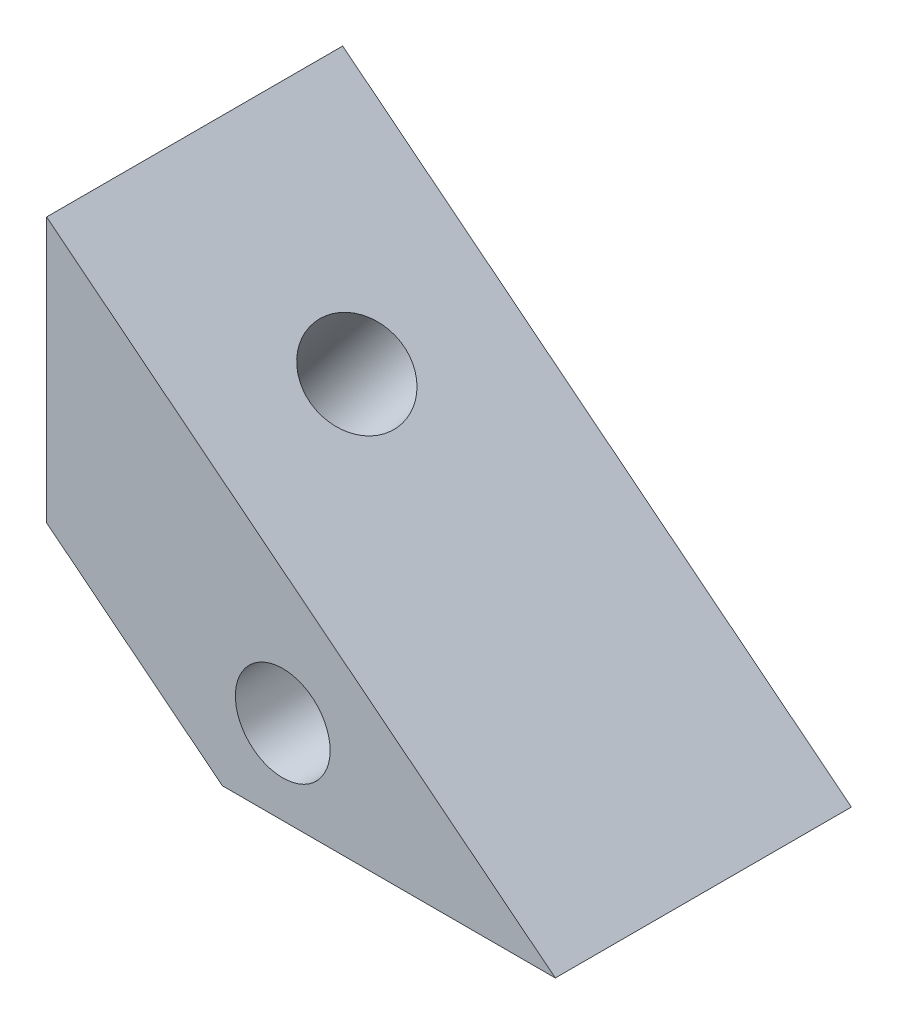
ISO-10303-21;
HEADER;
FILE_DESCRIPTION(('STEP AP214'),'2;1');
FILE_NAME('part.step','',(''),(''),'','','');
FILE_SCHEMA(('AUTOMOTIVE_DESIGN { 1 0 10303 214 1 1 1 1 }'));
ENDSEC;
DATA;
#1=APPLICATION_CONTEXT('core data for automotive mechanical design processes');
#2=APPLICATION_PROTOCOL_DEFINITION('international standard','automotive_design',2000,#1);
#3=PRODUCT_CONTEXT('',#1,'mechanical');
#4=PRODUCT('Part','Part','',(#3));
#5=PRODUCT_RELATED_PRODUCT_CATEGORY('part','',(#4));
#6=PRODUCT_DEFINITION_FORMATION('','',#4);
#7=PRODUCT_DEFINITION_CONTEXT('part definition',#1,'design');
#8=PRODUCT_DEFINITION('design','',#6,#7);
#9=PRODUCT_DEFINITION_SHAPE('','',#8);
#10=(LENGTH_UNIT() NAMED_UNIT(*) SI_UNIT(.MILLI.,.METRE.));
#11=(NAMED_UNIT(*) PLANE_ANGLE_UNIT() SI_UNIT($,.RADIAN.));
#12=(NAMED_UNIT(*) SI_UNIT($,.STERADIAN.) SOLID_ANGLE_UNIT());
#13=UNCERTAINTY_MEASURE_WITH_UNIT(LENGTH_MEASURE(1.E-05),#10,'distance_accuracy_value','');
#14=(GEOMETRIC_REPRESENTATION_CONTEXT(3) GLOBAL_UNCERTAINTY_ASSIGNED_CONTEXT((#13)) GLOBAL_UNIT_ASSIGNED_CONTEXT((#10,
#11,#12)) REPRESENTATION_CONTEXT('',''));
#15=CARTESIAN_POINT('',(0.,0.,0.));
#16=DIRECTION('',(0.,0.,1.));
#17=DIRECTION('',(1.,0.,0.));
#18=AXIS2_PLACEMENT_3D('',#15,#16,#17);
#19=CARTESIAN_POINT('',(-1.18087962656431,0.937540612039793,-5.));
#20=DIRECTION('',(0.622523565821539,0.782601054175649,0.));
#21=DIRECTION('',(-0.782601054175649,0.622523565821539,0.));
#22=AXIS2_PLACEMENT_3D('',#19,#20,#21);
#23=CYLINDRICAL_SURFACE('',#22,1.6);
#24=CARTESIAN_POINT('',(5.47820737922954,9.30896427646635,-5.));
#25=DIRECTION('',(-0.622523565821539,-0.782601054175649,0.));
#26=DIRECTION('',(-0.782601054175649,0.622523565821539,0.));
#27=AXIS2_PLACEMENT_3D('',#24,#25,#26);
#28=CIRCLE('',#27,1.6);
#29=CARTESIAN_POINT('',(4.2260456925485,10.3050019817808,-5.));
#30=VERTEX_POINT('',#29);
#31=EDGE_CURVE('E205',#30,#30,#28,.T.);
#32=ORIENTED_EDGE('',*,*,#31,.F.);
#33=EDGE_LOOP('',(#32));
#34=FACE_BOUND('',#33,.T.);
#35=CARTESIAN_POINT('',(2.67685133303261,5.78725953267592,-5.));
#36=DIRECTION('',(0.622523565821539,0.782601054175649,0.));
#37=DIRECTION('',(0.782601054175649,-0.622523565821539,0.));
#38=AXIS2_PLACEMENT_3D('',#35,#36,#37);
#39=CIRCLE('',#38,1.6);
#40=CARTESIAN_POINT('',(3.92901301971365,4.79122182736146,-5.));
#41=VERTEX_POINT('',#40);
#42=EDGE_CURVE('E197',#41,#41,#39,.F.);
#43=ORIENTED_EDGE('',*,*,#42,.T.);
#44=EDGE_LOOP('',(#43));
#45=FACE_BOUND('',#44,.T.);
#46=ADVANCED_FACE('F34',(#34,#45),#23,.F.);
#47=CARTESIAN_POINT('',(7.97577106518184,2.85,-10.));
#48=DIRECTION('',(0.,0.,1.));
#49=DIRECTION('',(-1.,0.,0.));
#50=AXIS2_PLACEMENT_3D('',#47,#48,#49);
#51=CYLINDRICAL_SURFACE('',#50,1.6);
#52=CARTESIAN_POINT('',(7.97577106518184,2.85,0.));
#53=DIRECTION('',(0.,0.,1.));
#54=DIRECTION('',(1.,0.,0.));
#55=AXIS2_PLACEMENT_3D('',#52,#53,#54);
#56=CIRCLE('',#55,1.6);
#57=CARTESIAN_POINT('',(9.57577106518184,2.85,0.));
#58=VERTEX_POINT('',#57);
#59=EDGE_CURVE('E253',#58,#58,#56,.T.);
#60=ORIENTED_EDGE('',*,*,#59,.T.);
#61=EDGE_LOOP('',(#60));
#62=FACE_BOUND('',#61,.T.);
#63=CARTESIAN_POINT('',(7.97577106518184,2.85,-4.5));
#64=DIRECTION('',(0.,0.,1.));
#65=DIRECTION('',(1.,0.,0.));
#66=AXIS2_PLACEMENT_3D('',#63,#64,#65);
#67=CIRCLE('',#66,1.6);
#68=CARTESIAN_POINT('',(9.57577106518184,2.85,-4.5));
#69=VERTEX_POINT('',#68);
#70=EDGE_CURVE('E252',#69,#69,#67,.T.);
#71=ORIENTED_EDGE('',*,*,#70,.F.);
#72=EDGE_LOOP('',(#71));
#73=FACE_BOUND('',#72,.T.);
#74=ADVANCED_FACE('F343',(#62,#73),#51,.F.);
#75=CARTESIAN_POINT('',(0.,13.6666292372171,-10.));
#76=DIRECTION('',(0.,0.,-1.));
#77=DIRECTION('',(1.,0.,0.));
#78=AXIS2_PLACEMENT_3D('',#75,#76,#77);
#79=PLANE('',#78);
#80=DIRECTION('',(0.500000000000001,-0.866025403784438,0.));
#81=VECTOR('',#80,1.);
#82=CARTESIAN_POINT('',(4.68487453080097,2.85,-10.));
#83=LINE('',#82,#81);
#84=CARTESIAN_POINT('',(4.68487453080097,2.85,-10.));
#85=VERTEX_POINT('',#84);
#86=CARTESIAN_POINT('',(6.33032279799141,0.,-10.));
#87=VERTEX_POINT('',#86);
#88=EDGE_CURVE('E208',#85,#87,#83,.T.);
#89=ORIENTED_EDGE('',*,*,#88,.T.);
#90=DIRECTION('',(1.,0.,0.));
#91=VECTOR('',#90,1.);
#92=CARTESIAN_POINT('',(17.1809053267872,0.,-10.));
#93=LINE('',#92,#91);
#94=CARTESIAN_POINT('',(5.93635108929075,0.,-10.));
#95=VERTEX_POINT('',#94);
#96=EDGE_CURVE('E268',#95,#87,#93,.T.);
#97=ORIENTED_EDGE('',*,*,#96,.F.);
#98=DIRECTION('',(0.782601054175649,-0.622523565821538,0.));
#99=VECTOR('',#98,1.);
#100=CARTESIAN_POINT('',(5.93635108929075,0.,-10.));
#101=LINE('',#100,#99);
#102=CARTESIAN_POINT('',(0.,4.72209745739037,-10.));
#103=VERTEX_POINT('',#102);
#104=EDGE_CURVE('E264',#103,#95,#101,.T.);
#105=ORIENTED_EDGE('',*,*,#104,.F.);
#106=DIRECTION('',(0.,-1.,0.));
#107=VECTOR('',#106,1.);
#108=CARTESIAN_POINT('',(0.,4.72209745739037,-10.));
#109=LINE('',#108,#107);
#110=CARTESIAN_POINT('',(0.,13.6666292372171,-10.));
#111=VERTEX_POINT('',#110);
#112=EDGE_CURVE('E260',#111,#103,#109,.T.);
#113=ORIENTED_EDGE('',*,*,#112,.F.);
#114=DIRECTION('',(-0.782601054175649,0.622523565821539,0.));
#115=VECTOR('',#114,1.);
#116=CARTESIAN_POINT('',(0.,13.6666292372171,-10.));
#117=LINE('',#116,#115);
#118=CARTESIAN_POINT('',(17.1809053267872,0.,-10.));
#119=VERTEX_POINT('',#118);
#120=EDGE_CURVE('E257',#119,#111,#117,.T.);
#121=ORIENTED_EDGE('',*,*,#120,.F.);
#122=CARTESIAN_POINT('',(9.62121933237227,0.,-10.));
#123=VERTEX_POINT('',#122);
#124=EDGE_CURVE('E267',#123,#119,#93,.T.);
#125=ORIENTED_EDGE('',*,*,#124,.F.);
#126=DIRECTION('',(0.5,0.866025403784439,0.));
#127=VECTOR('',#126,1.);
#128=CARTESIAN_POINT('',(9.62121933237227,0.,-10.));
#129=LINE('',#128,#127);
#130=CARTESIAN_POINT('',(11.2666675995627,2.85,-10.));
#131=VERTEX_POINT('',#130);
#132=EDGE_CURVE('E227',#123,#131,#129,.T.);
#133=ORIENTED_EDGE('',*,*,#132,.T.);
#134=DIRECTION('',(-0.5,0.866025403784439,0.));
#135=VECTOR('',#134,1.);
#136=CARTESIAN_POINT('',(11.2666675995627,2.85,-10.));
#137=LINE('',#136,#135);
#138=CARTESIAN_POINT('',(9.62121933237227,5.7,-10.));
#139=VERTEX_POINT('',#138);
#140=EDGE_CURVE('E230',#131,#139,#137,.T.);
#141=ORIENTED_EDGE('',*,*,#140,.T.);
#142=DIRECTION('',(-1.,0.,0.));
#143=VECTOR('',#142,1.);
#144=CARTESIAN_POINT('',(9.62121933237227,5.7,-10.));
#145=LINE('',#144,#143);
#146=CARTESIAN_POINT('',(6.33032279799141,5.7,-10.));
#147=VERTEX_POINT('',#146);
#148=EDGE_CURVE('E233',#139,#147,#145,.T.);
#149=ORIENTED_EDGE('',*,*,#148,.T.);
#150=DIRECTION('',(-0.5,-0.866025403784438,0.));
#151=VECTOR('',#150,1.);
#152=CARTESIAN_POINT('',(6.33032279799141,5.7,-10.));
#153=LINE('',#152,#151);
#154=EDGE_CURVE('E236',#147,#85,#153,.T.);
#155=ORIENTED_EDGE('',*,*,#154,.T.);
#156=EDGE_LOOP('',(#89,#97,#105,#113,#121,#125,#133,#141,#149,#155));
#157=FACE_BOUND('',#156,.T.);
#158=ADVANCED_FACE('F312',(#157),#79,.T.);
#159=CARTESIAN_POINT('',(0.,13.6666292372171,0.));
#160=DIRECTION('',(0.,0.,-1.));
#161=DIRECTION('',(1.,0.,0.));
#162=AXIS2_PLACEMENT_3D('',#159,#160,#161);
#163=PLANE('',#162);
#164=DIRECTION('',(-0.782601054175649,0.622523565821539,0.));
#165=VECTOR('',#164,1.);
#166=CARTESIAN_POINT('',(0.,13.6666292372171,0.));
#167=LINE('',#166,#165);
#168=CARTESIAN_POINT('',(17.1809053267872,0.,0.));
#169=VERTEX_POINT('',#168);
#170=CARTESIAN_POINT('',(0.,13.6666292372171,0.));
#171=VERTEX_POINT('',#170);
#172=EDGE_CURVE('E256',#169,#171,#167,.T.);
#173=ORIENTED_EDGE('',*,*,#172,.T.);
#174=DIRECTION('',(0.,-1.,0.));
#175=VECTOR('',#174,1.);
#176=CARTESIAN_POINT('',(0.,4.72209745739037,0.));
#177=LINE('',#176,#175);
#178=CARTESIAN_POINT('',(0.,4.72209745739037,0.));
#179=VERTEX_POINT('',#178);
#180=EDGE_CURVE('E274',#171,#179,#177,.T.);
#181=ORIENTED_EDGE('',*,*,#180,.T.);
#182=DIRECTION('',(0.782601054175649,-0.622523565821538,0.));
#183=VECTOR('',#182,1.);
#184=CARTESIAN_POINT('',(5.93635108929075,0.,0.));
#185=LINE('',#184,#183);
#186=CARTESIAN_POINT('',(5.93635108929075,0.,0.));
#187=VERTEX_POINT('',#186);
#188=EDGE_CURVE('E277',#179,#187,#185,.T.);
#189=ORIENTED_EDGE('',*,*,#188,.T.);
#190=DIRECTION('',(1.,0.,0.));
#191=VECTOR('',#190,1.);
#192=CARTESIAN_POINT('',(17.1809053267872,0.,0.));
#193=LINE('',#192,#191);
#194=EDGE_CURVE('E261',#187,#169,#193,.T.);
#195=ORIENTED_EDGE('',*,*,#194,.T.);
#196=EDGE_LOOP('',(#173,#181,#189,#195));
#197=FACE_BOUND('',#196,.T.);
#198=ORIENTED_EDGE('',*,*,#59,.F.);
#199=EDGE_LOOP('',(#198));
#200=FACE_BOUND('',#199,.T.);
#201=ADVANCED_FACE('F321',(#197,#200),#163,.F.);
#202=CARTESIAN_POINT('',(0.,13.6666292372171,-10.));
#203=DIRECTION('',(-0.622523565821539,-0.782601054175649,0.));
#204=DIRECTION('',(0.782601054175649,-0.622523565821539,0.));
#205=AXIS2_PLACEMENT_3D('',#202,#203,#204);
#206=PLANE('',#205);
#207=ORIENTED_EDGE('',*,*,#31,.T.);
#208=EDGE_LOOP('',(#207));
#209=FACE_BOUND('',#208,.T.);
#210=ORIENTED_EDGE('',*,*,#172,.F.);
#211=DIRECTION('',(0.,0.,1.));
#212=VECTOR('',#211,1.);
#213=CARTESIAN_POINT('',(17.1809053267872,0.,-10.));
#214=LINE('',#213,#212);
#215=EDGE_CURVE('E271',#119,#169,#214,.T.);
#216=ORIENTED_EDGE('',*,*,#215,.F.);
#217=ORIENTED_EDGE('',*,*,#120,.T.);
#218=DIRECTION('',(0.,0.,1.));
#219=VECTOR('',#218,1.);
#220=CARTESIAN_POINT('',(0.,13.6666292372171,-10.));
#221=LINE('',#220,#219);
#222=EDGE_CURVE('E288',#111,#171,#221,.T.);
#223=ORIENTED_EDGE('',*,*,#222,.T.);
#224=EDGE_LOOP('',(#210,#216,#217,#223));
#225=FACE_BOUND('',#224,.T.);
#226=ADVANCED_FACE('F36',(#209,#225),#206,.F.);
#227=CARTESIAN_POINT('',(0.,4.72209745739037,-10.));
#228=DIRECTION('',(1.,0.,0.));
#229=DIRECTION('',(0.,1.,0.));
#230=AXIS2_PLACEMENT_3D('',#227,#228,#229);
#231=PLANE('',#230);
#232=DIRECTION('',(0.,0.,1.));
#233=VECTOR('',#232,1.);
#234=CARTESIAN_POINT('',(0.,4.72209745739037,-10.));
#235=LINE('',#234,#233);
#236=CARTESIAN_POINT('',(0.,4.72209745739037,-2.15));
#237=VERTEX_POINT('',#236);
#238=EDGE_CURVE('E285',#237,#179,#235,.T.);
#239=ORIENTED_EDGE('',*,*,#238,.T.);
#240=ORIENTED_EDGE('',*,*,#180,.F.);
#241=ORIENTED_EDGE('',*,*,#222,.F.);
#242=ORIENTED_EDGE('',*,*,#112,.T.);
#243=CARTESIAN_POINT('',(0.,4.72209745739037,-7.85));
#244=VERTEX_POINT('',#243);
#245=EDGE_CURVE('E286',#103,#244,#235,.T.);
#246=ORIENTED_EDGE('',*,*,#245,.T.);
#247=DIRECTION('',(0.,-1.,0.));
#248=VECTOR('',#247,1.);
#249=CARTESIAN_POINT('',(0.,4.72209745739037,-7.85));
#250=LINE('',#249,#248);
#251=CARTESIAN_POINT('',(0.,5.06526532620885,-7.85));
#252=VERTEX_POINT('',#251);
#253=EDGE_CURVE('E174',#252,#244,#250,.T.);
#254=ORIENTED_EDGE('',*,*,#253,.F.);
#255=DIRECTION('',(0.,-0.680003614074999,-0.733208759389125));
#256=VECTOR('',#255,1.);
#257=CARTESIAN_POINT('',(0.,3.83462591349338,-9.17692764917121));
#258=LINE('',#257,#256);
#259=CARTESIAN_POINT('',(0.,7.70845565269705,-5.));
#260=VERTEX_POINT('',#259);
#261=EDGE_CURVE('E42',#260,#252,#258,.T.);
#262=ORIENTED_EDGE('',*,*,#261,.F.);
#263=DIRECTION('',(0.,0.680003614075,-0.733208759389124));
#264=VECTOR('',#263,1.);
#265=CARTESIAN_POINT('',(0.,8.8204719760539,-6.19902319927818));
#266=LINE('',#265,#264);
#267=CARTESIAN_POINT('',(0.,5.06526532620885,-2.15));
#268=VERTEX_POINT('',#267);
#269=EDGE_CURVE('E12',#268,#260,#266,.T.);
#270=ORIENTED_EDGE('',*,*,#269,.F.);
#271=DIRECTION('',(0.,1.,0.));
#272=VECTOR('',#271,1.);
#273=CARTESIAN_POINT('',(0.,4.72209745739037,-2.15));
#274=LINE('',#273,#272);
#275=EDGE_CURVE('E202',#237,#268,#274,.T.);
#276=ORIENTED_EDGE('',*,*,#275,.F.);
#277=EDGE_LOOP('',(#239,#240,#241,#242,#246,#254,#262,#270,#276));
#278=FACE_BOUND('',#277,.T.);
#279=ADVANCED_FACE('F305',(#278),#231,.F.);
#280=CARTESIAN_POINT('',(5.93635108929075,0.,-10.));
#281=DIRECTION('',(0.622523565821538,0.782601054175649,0.));
#282=DIRECTION('',(-0.782601054175649,0.622523565821538,0.));
#283=AXIS2_PLACEMENT_3D('',#280,#281,#282);
#284=PLANE('',#283);
#285=DIRECTION('',(0.391300527087824,-0.311261782910769,-0.866025403784439));
#286=VECTOR('',#285,1.);
#287=CARTESIAN_POINT('',(2.40827196697349,2.80642657457054,-2.15));
#288=LINE('',#287,#286);
#289=CARTESIAN_POINT('',(2.40827196697349,2.80642657457054,-2.15));
#290=VERTEX_POINT('',#289);
#291=CARTESIAN_POINT('',(3.69600151546822,1.78209625190428,-5.));
#292=VERTEX_POINT('',#291);
#293=EDGE_CURVE('E181',#290,#292,#288,.T.);
#294=ORIENTED_EDGE('',*,*,#293,.T.);
#295=DIRECTION('',(-0.391300527087825,0.311261782910769,-0.866025403784438));
#296=VECTOR('',#295,1.);
#297=CARTESIAN_POINT('',(3.69600151546822,1.78209625190428,-5.));
#298=LINE('',#297,#296);
#299=CARTESIAN_POINT('',(2.40827196697349,2.80642657457055,-7.85));
#300=VERTEX_POINT('',#299);
#301=EDGE_CURVE('E162',#292,#300,#298,.T.);
#302=ORIENTED_EDGE('',*,*,#301,.T.);
#303=DIRECTION('',(-0.782601054175649,0.622523565821539,0.));
#304=VECTOR('',#303,1.);
#305=CARTESIAN_POINT('',(2.40827196697349,2.80642657457055,-7.85));
#306=LINE('',#305,#304);
#307=EDGE_CURVE('E171',#300,#244,#306,.T.);
#308=ORIENTED_EDGE('',*,*,#307,.T.);
#309=ORIENTED_EDGE('',*,*,#245,.F.);
#310=ORIENTED_EDGE('',*,*,#104,.T.);
#311=DIRECTION('',(0.,0.,1.));
#312=VECTOR('',#311,1.);
#313=CARTESIAN_POINT('',(5.93635108929075,0.,-10.));
#314=LINE('',#313,#312);
#315=EDGE_CURVE('E283',#95,#187,#314,.T.);
#316=ORIENTED_EDGE('',*,*,#315,.T.);
#317=ORIENTED_EDGE('',*,*,#188,.F.);
#318=ORIENTED_EDGE('',*,*,#238,.F.);
#319=DIRECTION('',(0.782601054175649,-0.622523565821539,0.));
#320=VECTOR('',#319,1.);
#321=CARTESIAN_POINT('',(-0.167187130015962,4.85508721990307,-2.15));
#322=LINE('',#321,#320);
#323=EDGE_CURVE('E177',#237,#290,#322,.T.);
#324=ORIENTED_EDGE('',*,*,#323,.T.);
#325=EDGE_LOOP('',(#294,#302,#308,#309,#310,#316,#317,#318,#324));
#326=FACE_BOUND('',#325,.T.);
#327=ADVANCED_FACE('F179',(#326),#284,.F.);
#328=CARTESIAN_POINT('',(17.1809053267872,0.,-10.));
#329=DIRECTION('',(0.,1.,0.));
#330=DIRECTION('',(-1.,0.,0.));
#331=AXIS2_PLACEMENT_3D('',#328,#329,#330);
#332=PLANE('',#331);
#333=DIRECTION('',(-1.,0.,0.));
#334=VECTOR('',#333,1.);
#335=CARTESIAN_POINT('',(6.33032279799141,0.,-4.5));
#336=LINE('',#335,#334);
#337=CARTESIAN_POINT('',(9.62121933237227,0.,-4.5));
#338=VERTEX_POINT('',#337);
#339=CARTESIAN_POINT('',(6.33032279799141,0.,-4.5));
#340=VERTEX_POINT('',#339);
#341=EDGE_CURVE('E224',#338,#340,#336,.T.);
#342=ORIENTED_EDGE('',*,*,#341,.F.);
#343=DIRECTION('',(0.,0.,-1.));
#344=VECTOR('',#343,1.);
#345=CARTESIAN_POINT('',(9.62121933237227,0.,8.70689382041609));
#346=LINE('',#345,#344);
#347=EDGE_CURVE('E247',#338,#123,#346,.T.);
#348=ORIENTED_EDGE('',*,*,#347,.T.);
#349=ORIENTED_EDGE('',*,*,#124,.T.);
#350=ORIENTED_EDGE('',*,*,#215,.T.);
#351=ORIENTED_EDGE('',*,*,#194,.F.);
#352=ORIENTED_EDGE('',*,*,#315,.F.);
#353=ORIENTED_EDGE('',*,*,#96,.T.);
#354=DIRECTION('',(0.,0.,-1.));
#355=VECTOR('',#354,1.);
#356=CARTESIAN_POINT('',(6.33032279799141,0.,8.70689382041609));
#357=LINE('',#356,#355);
#358=EDGE_CURVE('E239',#340,#87,#357,.T.);
#359=ORIENTED_EDGE('',*,*,#358,.F.);
#360=EDGE_LOOP('',(#342,#348,#349,#350,#351,#352,#353,#359));
#361=FACE_BOUND('',#360,.T.);
#362=ADVANCED_FACE('F317',(#361),#332,.F.);
#363=CARTESIAN_POINT('',(4.68487453080097,2.85,8.70689382041609));
#364=DIRECTION('',(-0.866025403784438,-0.500000000000001,0.));
#365=DIRECTION('',(0.500000000000001,-0.866025403784438,0.));
#366=AXIS2_PLACEMENT_3D('',#363,#364,#365);
#367=PLANE('',#366);
#368=DIRECTION('',(-0.500000000000001,0.866025403784438,0.));
#369=VECTOR('',#368,1.);
#370=CARTESIAN_POINT('',(4.68487453080097,2.85,-4.5));
#371=LINE('',#370,#369);
#372=CARTESIAN_POINT('',(4.68487453080097,2.85,-4.5));
#373=VERTEX_POINT('',#372);
#374=EDGE_CURVE('E221',#340,#373,#371,.T.);
#375=ORIENTED_EDGE('',*,*,#374,.F.);
#376=ORIENTED_EDGE('',*,*,#358,.T.);
#377=ORIENTED_EDGE('',*,*,#88,.F.);
#378=DIRECTION('',(0.,0.,-1.));
#379=VECTOR('',#378,1.);
#380=CARTESIAN_POINT('',(4.68487453080097,2.85,8.70689382041609));
#381=LINE('',#380,#379);
#382=EDGE_CURVE('E212',#373,#85,#381,.T.);
#383=ORIENTED_EDGE('',*,*,#382,.F.);
#384=EDGE_LOOP('',(#375,#376,#377,#383));
#385=FACE_BOUND('',#384,.T.);
#386=ADVANCED_FACE('F363',(#385),#367,.F.);
#387=CARTESIAN_POINT('',(6.33032279799141,5.7,8.70689382041609));
#388=DIRECTION('',(-0.866025403784438,0.5,0.));
#389=DIRECTION('',(-0.5,-0.866025403784438,0.));
#390=AXIS2_PLACEMENT_3D('',#387,#388,#389);
#391=PLANE('',#390);
#392=DIRECTION('',(0.,0.,-1.));
#393=VECTOR('',#392,1.);
#394=CARTESIAN_POINT('',(5.21502903711291,3.76825454079387,8.70689382041609));
#395=LINE('',#394,#393);
#396=CARTESIAN_POINT('',(5.21502903711291,3.76825454079387,-4.91748890913058));
#397=VERTEX_POINT('',#396);
#398=CARTESIAN_POINT('',(5.21502903711291,3.76825454079387,-5.08251109086943));
#399=VERTEX_POINT('',#398);
#400=EDGE_CURVE('E198',#397,#399,#395,.T.);
#401=ORIENTED_EDGE('',*,*,#400,.T.);
#402=DIRECTION('',(0.484375872290359,0.838963620767395,-0.248032371620754));
#403=VECTOR('',#402,1.);
#404=CARTESIAN_POINT('',(4.60503839552223,2.71171975741727,-4.7701556781508));
#405=LINE('',#404,#403);
#406=CARTESIAN_POINT('',(5.05389530544575,3.48916273073317,-5.));
#407=VERTEX_POINT('',#406);
#408=EDGE_CURVE('E290',#407,#399,#405,.T.);
#409=ORIENTED_EDGE('',*,*,#408,.F.);
#410=DIRECTION('',(-0.484375872290359,-0.838963620767395,-0.248032371620754));
#411=VECTOR('',#410,1.);
#412=CARTESIAN_POINT('',(7.89855541531584,8.41625857129264,-3.54334653340644));
#413=LINE('',#412,#411);
#414=EDGE_CURVE('E296',#397,#407,#413,.T.);
#415=ORIENTED_EDGE('',*,*,#414,.F.);
#416=EDGE_LOOP('',(#401,#409,#415));
#417=FACE_BOUND('',#416,.T.);
#418=DIRECTION('',(0.5,0.866025403784439,0.));
#419=VECTOR('',#418,1.);
#420=CARTESIAN_POINT('',(6.33032279799141,5.7,-4.5));
#421=LINE('',#420,#419);
#422=CARTESIAN_POINT('',(6.33032279799141,5.7,-4.5));
#423=VERTEX_POINT('',#422);
#424=EDGE_CURVE('E218',#373,#423,#421,.T.);
#425=ORIENTED_EDGE('',*,*,#424,.F.);
#426=ORIENTED_EDGE('',*,*,#382,.T.);
#427=ORIENTED_EDGE('',*,*,#154,.F.);
#428=DIRECTION('',(0.,0.,-1.));
#429=VECTOR('',#428,1.);
#430=CARTESIAN_POINT('',(6.33032279799141,5.7,8.70689382041609));
#431=LINE('',#430,#429);
#432=EDGE_CURVE('E241',#423,#147,#431,.T.);
#433=ORIENTED_EDGE('',*,*,#432,.F.);
#434=EDGE_LOOP('',(#425,#426,#427,#433));
#435=FACE_BOUND('',#434,.T.);
#436=ADVANCED_FACE('F359',(#417,#435),#391,.F.);
#437=CARTESIAN_POINT('',(9.62121933237227,5.7,8.70689382041609));
#438=DIRECTION('',(0.,1.,0.));
#439=DIRECTION('',(0.,0.,-1.));
#440=AXIS2_PLACEMENT_3D('',#437,#438,#439);
#441=PLANE('',#440);
#442=DIRECTION('',(1.,0.,0.));
#443=VECTOR('',#442,1.);
#444=CARTESIAN_POINT('',(9.62121933237227,5.7,-4.5));
#445=LINE('',#444,#443);
#446=CARTESIAN_POINT('',(9.62121933237227,5.7,-4.5));
#447=VERTEX_POINT('',#446);
#448=EDGE_CURVE('E215',#423,#447,#445,.T.);
#449=ORIENTED_EDGE('',*,*,#448,.F.);
#450=ORIENTED_EDGE('',*,*,#432,.T.);
#451=ORIENTED_EDGE('',*,*,#148,.F.);
#452=DIRECTION('',(0.,0.,-1.));
#453=VECTOR('',#452,1.);
#454=CARTESIAN_POINT('',(9.62121933237227,5.7,8.70689382041609));
#455=LINE('',#454,#453);
#456=EDGE_CURVE('E243',#447,#139,#455,.T.);
#457=ORIENTED_EDGE('',*,*,#456,.F.);
#458=EDGE_LOOP('',(#449,#450,#451,#457));
#459=FACE_BOUND('',#458,.T.);
#460=ADVANCED_FACE('F362',(#459),#441,.F.);
#461=CARTESIAN_POINT('',(11.2666675995627,2.85,8.70689382041609));
#462=DIRECTION('',(0.866025403784438,0.5,0.));
#463=DIRECTION('',(-0.5,0.866025403784439,0.));
#464=AXIS2_PLACEMENT_3D('',#461,#462,#463);
#465=PLANE('',#464);
#466=DIRECTION('',(0.5,-0.866025403784439,0.));
#467=VECTOR('',#466,1.);
#468=CARTESIAN_POINT('',(11.2666675995627,2.85,-4.5));
#469=LINE('',#468,#467);
#470=CARTESIAN_POINT('',(11.2666675995627,2.85,-4.5));
#471=VERTEX_POINT('',#470);
#472=EDGE_CURVE('E211',#447,#471,#469,.T.);
#473=ORIENTED_EDGE('',*,*,#472,.F.);
#474=ORIENTED_EDGE('',*,*,#456,.T.);
#475=ORIENTED_EDGE('',*,*,#140,.F.);
#476=DIRECTION('',(0.,0.,-1.));
#477=VECTOR('',#476,1.);
#478=CARTESIAN_POINT('',(11.2666675995627,2.85,8.70689382041609));
#479=LINE('',#478,#477);
#480=EDGE_CURVE('E245',#471,#131,#479,.T.);
#481=ORIENTED_EDGE('',*,*,#480,.F.);
#482=EDGE_LOOP('',(#473,#474,#475,#481));
#483=FACE_BOUND('',#482,.T.);
#484=ADVANCED_FACE('F367',(#483),#465,.F.);
#485=CARTESIAN_POINT('',(9.62121933237227,0.,8.70689382041609));
#486=DIRECTION('',(0.866025403784439,-0.5,0.));
#487=DIRECTION('',(0.5,0.866025403784439,0.));
#488=AXIS2_PLACEMENT_3D('',#485,#486,#487);
#489=PLANE('',#488);
#490=DIRECTION('',(-0.5,-0.866025403784439,0.));
#491=VECTOR('',#490,1.);
#492=CARTESIAN_POINT('',(9.62121933237227,0.,-4.5));
#493=LINE('',#492,#491);
#494=EDGE_CURVE('E209',#471,#338,#493,.T.);
#495=ORIENTED_EDGE('',*,*,#494,.F.);
#496=ORIENTED_EDGE('',*,*,#480,.T.);
#497=ORIENTED_EDGE('',*,*,#132,.F.);
#498=ORIENTED_EDGE('',*,*,#347,.F.);
#499=EDGE_LOOP('',(#495,#496,#497,#498));
#500=FACE_BOUND('',#499,.T.);
#501=ADVANCED_FACE('F357',(#500),#489,.F.);
#502=CARTESIAN_POINT('',(0.,13.6666292372171,-4.5));
#503=DIRECTION('',(0.,0.,-1.));
#504=DIRECTION('',(1.,0.,0.));
#505=AXIS2_PLACEMENT_3D('',#502,#503,#504);
#506=PLANE('',#505);
#507=ORIENTED_EDGE('',*,*,#70,.T.);
#508=EDGE_LOOP('',(#507));
#509=FACE_BOUND('',#508,.T.);
#510=ORIENTED_EDGE('',*,*,#374,.T.);
#511=ORIENTED_EDGE('',*,*,#424,.T.);
#512=ORIENTED_EDGE('',*,*,#448,.T.);
#513=ORIENTED_EDGE('',*,*,#472,.T.);
#514=ORIENTED_EDGE('',*,*,#494,.T.);
#515=ORIENTED_EDGE('',*,*,#341,.T.);
#516=EDGE_LOOP('',(#510,#511,#512,#513,#514,#515));
#517=FACE_BOUND('',#516,.T.);
#518=ADVANCED_FACE('F353',(#509,#517),#506,.T.);
#519=CARTESIAN_POINT('',(8.32299487055503,18.1716492042519,-5.));
#520=DIRECTION('',(-0.677752393944594,0.539121222455927,0.5));
#521=DIRECTION('',(-0.622523565821539,-0.782601054175649,0.));
#522=AXIS2_PLACEMENT_3D('',#519,#520,#521);
#523=PLANE('',#522);
#524=DIRECTION('',(-0.622523565821539,-0.782601054175649,0.));
#525=VECTOR('',#524,1.);
#526=CARTESIAN_POINT('',(9.61072441904975,17.1473188815857,-2.15));
#527=LINE('',#526,#525);
#528=CARTESIAN_POINT('',(1.38912178453789,6.81158985534219,-2.15));
#529=VERTEX_POINT('',#528);
#530=EDGE_CURVE('E190',#529,#268,#527,.T.);
#531=ORIENTED_EDGE('',*,*,#530,.T.);
#532=ORIENTED_EDGE('',*,*,#269,.T.);
#533=DIRECTION('',(-0.622523565821539,-0.782601054175649,0.));
#534=VECTOR('',#533,1.);
#535=CARTESIAN_POINT('',(8.32299487055503,18.1716492042519,-5.));
#536=LINE('',#535,#534);
#537=CARTESIAN_POINT('',(0.101392236043159,7.83592017800845,-5.));
#538=VERTEX_POINT('',#537);
#539=EDGE_CURVE('E192',#538,#260,#536,.T.);
#540=ORIENTED_EDGE('',*,*,#539,.F.);
#541=DIRECTION('',(-0.391300527087824,0.311261782910769,-0.866025403784439));
#542=VECTOR('',#541,1.);
#543=CARTESIAN_POINT('',(0.101392236043158,7.83592017800845,-5.));
#544=LINE('',#543,#542);
#545=EDGE_CURVE('E530',#529,#538,#544,.T.);
#546=ORIENTED_EDGE('',*,*,#545,.F.);
#547=EDGE_LOOP('',(#531,#532,#540,#546));
#548=FACE_BOUND('',#547,.T.);
#549=ADVANCED_FACE('F356',(#548),#523,.F.);
#550=CARTESIAN_POINT('',(9.61072441904976,17.1473188815857,-7.85));
#551=DIRECTION('',(-0.677752393944594,0.539121222455927,-0.499999999999999));
#552=DIRECTION('',(-0.622523565821539,-0.782601054175649,0.));
#553=AXIS2_PLACEMENT_3D('',#550,#551,#552);
#554=PLANE('',#553);
#555=ORIENTED_EDGE('',*,*,#539,.T.);
#556=ORIENTED_EDGE('',*,*,#261,.T.);
#557=DIRECTION('',(-0.622523565821539,-0.782601054175649,0.));
#558=VECTOR('',#557,1.);
#559=CARTESIAN_POINT('',(9.61072441904976,17.1473188815857,-7.85));
#560=LINE('',#559,#558);
#561=CARTESIAN_POINT('',(1.38912178453789,6.81158985534219,-7.85));
#562=VERTEX_POINT('',#561);
#563=EDGE_CURVE('E168',#562,#252,#560,.T.);
#564=ORIENTED_EDGE('',*,*,#563,.F.);
#565=DIRECTION('',(0.391300527087824,-0.311261782910769,-0.866025403784439));
#566=VECTOR('',#565,1.);
#567=CARTESIAN_POINT('',(1.38912178453788,6.81158985534219,-7.85));
#568=LINE('',#567,#566);
#569=EDGE_CURVE('E528',#538,#562,#568,.T.);
#570=ORIENTED_EDGE('',*,*,#569,.F.);
#571=EDGE_LOOP('',(#555,#556,#564,#570));
#572=FACE_BOUND('',#571,.T.);
#573=ADVANCED_FACE('F301',(#572),#554,.F.);
#574=CARTESIAN_POINT('',(9.61072441904975,17.1473188815857,-2.15));
#575=DIRECTION('',(0.,0.,1.));
#576=DIRECTION('',(-1.,0.,0.));
#577=AXIS2_PLACEMENT_3D('',#574,#575,#576);
#578=PLANE('',#577);
#579=ORIENTED_EDGE('',*,*,#323,.F.);
#580=ORIENTED_EDGE('',*,*,#275,.T.);
#581=ORIENTED_EDGE('',*,*,#530,.F.);
#582=DIRECTION('',(-0.782601054175649,0.622523565821539,0.));
#583=VECTOR('',#582,1.);
#584=CARTESIAN_POINT('',(1.38912178453788,6.81158985534219,-2.15));
#585=LINE('',#584,#583);
#586=CARTESIAN_POINT('',(3.96458088152734,4.76292921000967,-2.15));
#587=VERTEX_POINT('',#586);
#588=EDGE_CURVE('E330',#587,#529,#585,.T.);
#589=ORIENTED_EDGE('',*,*,#588,.F.);
#590=DIRECTION('',(-0.622523565821539,-0.782601054175649,0.));
#591=VECTOR('',#590,1.);
#592=CARTESIAN_POINT('',(12.1861835160392,15.0986582362532,-2.15));
#593=LINE('',#592,#591);
#594=EDGE_CURVE('E187',#587,#290,#593,.T.);
#595=ORIENTED_EDGE('',*,*,#594,.T.);
#596=EDGE_LOOP('',(#579,#580,#581,#589,#595));
#597=FACE_BOUND('',#596,.T.);
#598=ADVANCED_FACE('F328',(#597),#578,.F.);
#599=CARTESIAN_POINT('',(12.1861835160392,15.0986582362532,-7.85));
#600=DIRECTION('',(0.,0.,-1.));
#601=DIRECTION('',(1.,0.,0.));
#602=AXIS2_PLACEMENT_3D('',#599,#600,#601);
#603=PLANE('',#602);
#604=ORIENTED_EDGE('',*,*,#563,.T.);
#605=ORIENTED_EDGE('',*,*,#253,.T.);
#606=ORIENTED_EDGE('',*,*,#307,.F.);
#607=DIRECTION('',(-0.622523565821539,-0.782601054175649,0.));
#608=VECTOR('',#607,1.);
#609=CARTESIAN_POINT('',(12.1861835160392,15.0986582362532,-7.85));
#610=LINE('',#609,#608);
#611=CARTESIAN_POINT('',(3.96458088152734,4.76292921000966,-7.85));
#612=VERTEX_POINT('',#611);
#613=EDGE_CURVE('E158',#612,#300,#610,.T.);
#614=ORIENTED_EDGE('',*,*,#613,.F.);
#615=DIRECTION('',(0.782601054175649,-0.622523565821539,0.));
#616=VECTOR('',#615,1.);
#617=CARTESIAN_POINT('',(3.96458088152734,4.76292921000967,-7.85));
#618=LINE('',#617,#616);
#619=EDGE_CURVE('E189',#562,#612,#618,.T.);
#620=ORIENTED_EDGE('',*,*,#619,.F.);
#621=EDGE_LOOP('',(#604,#605,#606,#614,#620));
#622=FACE_BOUND('',#621,.T.);
#623=ADVANCED_FACE('F172',(#622),#603,.F.);
#624=CARTESIAN_POINT('',(12.1861835160392,15.0986582362532,-2.15));
#625=DIRECTION('',(0.677752393944594,-0.539121222455927,0.5));
#626=DIRECTION('',(0.622523565821539,0.782601054175649,0.));
#627=AXIS2_PLACEMENT_3D('',#624,#625,#626);
#628=PLANE('',#627);
#629=DIRECTION('',(-0.391300527087824,0.311261782910769,0.866025403784439));
#630=VECTOR('',#629,1.);
#631=CARTESIAN_POINT('',(3.96458088152734,4.76292921000967,-2.15));
#632=LINE('',#631,#630);
#633=EDGE_CURVE('E55',#397,#587,#632,.T.);
#634=ORIENTED_EDGE('',*,*,#633,.F.);
#635=ORIENTED_EDGE('',*,*,#414,.T.);
#636=DIRECTION('',(-0.622523565821539,-0.782601054175649,0.));
#637=VECTOR('',#636,1.);
#638=CARTESIAN_POINT('',(13.4739130645339,14.0743279135869,-5.));
#639=LINE('',#638,#637);
#640=EDGE_CURVE('E49',#407,#292,#639,.T.);
#641=ORIENTED_EDGE('',*,*,#640,.T.);
#642=ORIENTED_EDGE('',*,*,#293,.F.);
#643=ORIENTED_EDGE('',*,*,#594,.F.);
#644=EDGE_LOOP('',(#634,#635,#641,#642,#643));
#645=FACE_BOUND('',#644,.T.);
#646=ADVANCED_FACE('F331',(#645),#628,.F.);
#647=CARTESIAN_POINT('',(13.4739130645339,14.0743279135869,-5.));
#648=DIRECTION('',(0.677752393944593,-0.539121222455926,-0.5));
#649=DIRECTION('',(0.622523565821539,0.782601054175649,0.));
#650=AXIS2_PLACEMENT_3D('',#647,#648,#649);
#651=PLANE('',#650);
#652=ORIENTED_EDGE('',*,*,#640,.F.);
#653=ORIENTED_EDGE('',*,*,#408,.T.);
#654=DIRECTION('',(0.391300527087824,-0.31126178291077,0.866025403784439));
#655=VECTOR('',#654,1.);
#656=CARTESIAN_POINT('',(5.25231043002206,3.7385988873434,-5.));
#657=LINE('',#656,#655);
#658=EDGE_CURVE('E165',#612,#399,#657,.T.);
#659=ORIENTED_EDGE('',*,*,#658,.F.);
#660=ORIENTED_EDGE('',*,*,#613,.T.);
#661=ORIENTED_EDGE('',*,*,#301,.F.);
#662=EDGE_LOOP('',(#652,#653,#659,#660,#661));
#663=FACE_BOUND('',#662,.T.);
#664=ADVANCED_FACE('F160',(#663),#651,.F.);
#665=CARTESIAN_POINT('',(-2.80135604619692,10.1449244934267,-10.));
#666=DIRECTION('',(-0.622523565821539,-0.782601054175649,0.));
#667=DIRECTION('',(0.782601054175649,-0.622523565821539,0.));
#668=AXIS2_PLACEMENT_3D('',#665,#666,#667);
#669=PLANE('',#668);
#670=ORIENTED_EDGE('',*,*,#42,.F.);
#671=EDGE_LOOP('',(#670));
#672=FACE_BOUND('',#671,.T.);
#673=ORIENTED_EDGE('',*,*,#400,.F.);
#674=ORIENTED_EDGE('',*,*,#633,.T.);
#675=ORIENTED_EDGE('',*,*,#588,.T.);
#676=ORIENTED_EDGE('',*,*,#545,.T.);
#677=ORIENTED_EDGE('',*,*,#569,.T.);
#678=ORIENTED_EDGE('',*,*,#619,.T.);
#679=ORIENTED_EDGE('',*,*,#658,.T.);
#680=EDGE_LOOP('',(#673,#674,#675,#676,#677,#678,#679));
#681=FACE_BOUND('',#680,.T.);
#682=ADVANCED_FACE('F338',(#672,#681),#669,.T.);
#683=CLOSED_SHELL('',(#46,#74,#158,#201,#226,#279,#327,#362,#386,#436,#460,#484,#501,#518,#549,
#573,#598,#623,#646,#664,#682));
#684=MANIFOLD_SOLID_BREP('B2',#683);
#685=ADVANCED_BREP_SHAPE_REPRESENTATION('',(#18,#684),#14);
#686=SHAPE_DEFINITION_REPRESENTATION(#9,#685);
ENDSEC;
END-ISO-10303-21;
